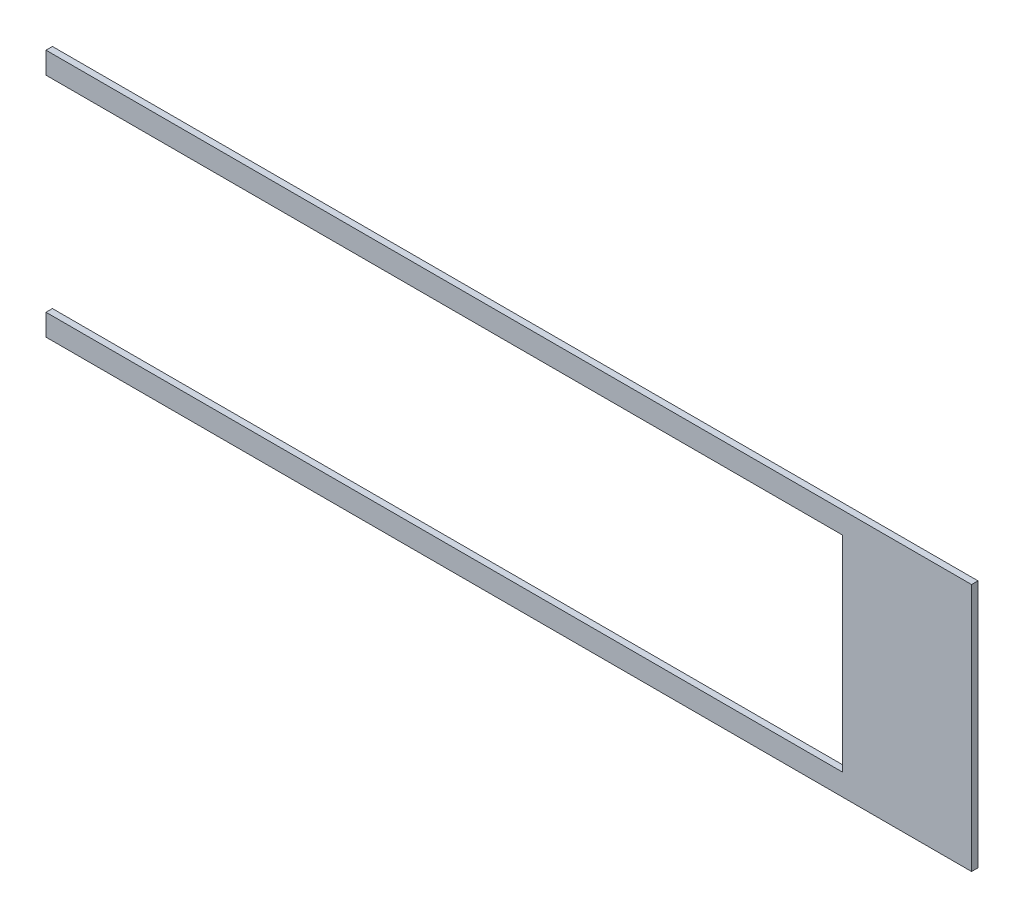
ISO-10303-21;
HEADER;
FILE_DESCRIPTION(('STEP AP214'),'2;1');
FILE_NAME('part.step','',(''),(''),'','','');
FILE_SCHEMA(('AUTOMOTIVE_DESIGN { 1 0 10303 214 1 1 1 1 }'));
ENDSEC;
DATA;
#1=APPLICATION_CONTEXT('core data for automotive mechanical design processes');
#2=APPLICATION_PROTOCOL_DEFINITION('international standard','automotive_design',2000,#1);
#3=PRODUCT_CONTEXT('',#1,'mechanical');
#4=PRODUCT('Part','Part','',(#3));
#5=PRODUCT_RELATED_PRODUCT_CATEGORY('part','',(#4));
#6=PRODUCT_DEFINITION_FORMATION('','',#4);
#7=PRODUCT_DEFINITION_CONTEXT('part definition',#1,'design');
#8=PRODUCT_DEFINITION('design','',#6,#7);
#9=PRODUCT_DEFINITION_SHAPE('','',#8);
#10=(LENGTH_UNIT() NAMED_UNIT(*) SI_UNIT(.MILLI.,.METRE.));
#11=(NAMED_UNIT(*) PLANE_ANGLE_UNIT() SI_UNIT($,.RADIAN.));
#12=(NAMED_UNIT(*) SI_UNIT($,.STERADIAN.) SOLID_ANGLE_UNIT());
#13=UNCERTAINTY_MEASURE_WITH_UNIT(LENGTH_MEASURE(1.E-05),#10,'distance_accuracy_value','');
#14=(GEOMETRIC_REPRESENTATION_CONTEXT(3) GLOBAL_UNCERTAINTY_ASSIGNED_CONTEXT((#13)) GLOBAL_UNIT_ASSIGNED_CONTEXT((#10,
#11,#12)) REPRESENTATION_CONTEXT('',''));
#15=CARTESIAN_POINT('',(0.,0.,0.));
#16=DIRECTION('',(0.,0.,1.));
#17=DIRECTION('',(1.,0.,0.));
#18=AXIS2_PLACEMENT_3D('',#15,#16,#17);
#19=CARTESIAN_POINT('',(-228.7016,-50.7492,3.175));
#20=DIRECTION('',(1.,0.,0.));
#21=DIRECTION('',(0.,0.,-1.));
#22=AXIS2_PLACEMENT_3D('',#19,#20,#21);
#23=PLANE('',#22);
#24=DIRECTION('',(0.,-1.,0.));
#25=VECTOR('',#24,1.);
#26=CARTESIAN_POINT('',(-228.7016,-50.7492,0.));
#27=LINE('',#26,#25);
#28=CARTESIAN_POINT('',(-228.7016,-50.7492,0.));
#29=VERTEX_POINT('',#28);
#30=CARTESIAN_POINT('',(-228.7016,-61.4172,0.));
#31=VERTEX_POINT('',#30);
#32=EDGE_CURVE('E140',#29,#31,#27,.T.);
#33=ORIENTED_EDGE('',*,*,#32,.T.);
#34=DIRECTION('',(0.,0.,-1.));
#35=VECTOR('',#34,1.);
#36=CARTESIAN_POINT('',(-228.7016,-61.4172,3.175));
#37=LINE('',#36,#35);
#38=CARTESIAN_POINT('',(-228.7016,-61.4172,3.175));
#39=VERTEX_POINT('',#38);
#40=EDGE_CURVE('E11',#39,#31,#37,.T.);
#41=ORIENTED_EDGE('',*,*,#40,.F.);
#42=DIRECTION('',(0.,-1.,0.));
#43=VECTOR('',#42,1.);
#44=CARTESIAN_POINT('',(-228.7016,-50.7492,3.175));
#45=LINE('',#44,#43);
#46=CARTESIAN_POINT('',(-228.7016,-50.7492,3.175));
#47=VERTEX_POINT('',#46);
#48=EDGE_CURVE('E162',#47,#39,#45,.T.);
#49=ORIENTED_EDGE('',*,*,#48,.F.);
#50=DIRECTION('',(0.,0.,-1.));
#51=VECTOR('',#50,1.);
#52=CARTESIAN_POINT('',(-228.7016,-50.7492,3.175));
#53=LINE('',#52,#51);
#54=EDGE_CURVE('E136',#47,#29,#53,.T.);
#55=ORIENTED_EDGE('',*,*,#54,.T.);
#56=EDGE_LOOP('',(#33,#41,#49,#55));
#57=FACE_BOUND('',#56,.T.);
#58=ADVANCED_FACE('F39',(#57),#23,.F.);
#59=CARTESIAN_POINT('',(-228.7016,-61.4172,3.175));
#60=DIRECTION('',(0.,1.,0.));
#61=DIRECTION('',(0.,0.,1.));
#62=AXIS2_PLACEMENT_3D('',#59,#60,#61);
#63=PLANE('',#62);
#64=DIRECTION('',(1.,0.,0.));
#65=VECTOR('',#64,1.);
#66=CARTESIAN_POINT('',(-228.7016,-61.4172,0.));
#67=LINE('',#66,#65);
#68=CARTESIAN_POINT('',(228.7016,-61.4172,0.));
#69=VERTEX_POINT('',#68);
#70=EDGE_CURVE('E144',#31,#69,#67,.T.);
#71=ORIENTED_EDGE('',*,*,#70,.T.);
#72=DIRECTION('',(0.,0.,-1.));
#73=VECTOR('',#72,1.);
#74=CARTESIAN_POINT('',(228.7016,-61.4172,3.175));
#75=LINE('',#74,#73);
#76=CARTESIAN_POINT('',(228.7016,-61.4172,3.175));
#77=VERTEX_POINT('',#76);
#78=EDGE_CURVE('E48',#77,#69,#75,.T.);
#79=ORIENTED_EDGE('',*,*,#78,.F.);
#80=DIRECTION('',(1.,0.,0.));
#81=VECTOR('',#80,1.);
#82=CARTESIAN_POINT('',(-228.7016,-61.4172,3.175));
#83=LINE('',#82,#81);
#84=EDGE_CURVE('E99',#39,#77,#83,.T.);
#85=ORIENTED_EDGE('',*,*,#84,.F.);
#86=ORIENTED_EDGE('',*,*,#40,.T.);
#87=EDGE_LOOP('',(#71,#79,#85,#86));
#88=FACE_BOUND('',#87,.T.);
#89=ADVANCED_FACE('F208',(#88),#63,.F.);
#90=CARTESIAN_POINT('',(228.7016,-61.4172,3.175));
#91=DIRECTION('',(-1.,0.,0.));
#92=DIRECTION('',(0.,0.,1.));
#93=AXIS2_PLACEMENT_3D('',#90,#91,#92);
#94=PLANE('',#93);
#95=DIRECTION('',(0.,1.,0.));
#96=VECTOR('',#95,1.);
#97=CARTESIAN_POINT('',(228.7016,-61.4172,0.));
#98=LINE('',#97,#96);
#99=CARTESIAN_POINT('',(228.7016,61.4172,0.));
#100=VERTEX_POINT('',#99);
#101=EDGE_CURVE('E147',#69,#100,#98,.T.);
#102=ORIENTED_EDGE('',*,*,#101,.T.);
#103=DIRECTION('',(0.,0.,-1.));
#104=VECTOR('',#103,1.);
#105=CARTESIAN_POINT('',(228.7016,61.4172,3.175));
#106=LINE('',#105,#104);
#107=CARTESIAN_POINT('',(228.7016,61.4172,3.175));
#108=VERTEX_POINT('',#107);
#109=EDGE_CURVE('E173',#108,#100,#106,.T.);
#110=ORIENTED_EDGE('',*,*,#109,.F.);
#111=DIRECTION('',(0.,1.,0.));
#112=VECTOR('',#111,1.);
#113=CARTESIAN_POINT('',(228.7016,-61.4172,3.175));
#114=LINE('',#113,#112);
#115=EDGE_CURVE('E183',#77,#108,#114,.T.);
#116=ORIENTED_EDGE('',*,*,#115,.F.);
#117=ORIENTED_EDGE('',*,*,#78,.T.);
#118=EDGE_LOOP('',(#102,#110,#116,#117));
#119=FACE_BOUND('',#118,.T.);
#120=ADVANCED_FACE('F181',(#119),#94,.F.);
#121=CARTESIAN_POINT('',(228.7016,61.4172,3.175));
#122=DIRECTION('',(0.,-1.,0.));
#123=DIRECTION('',(0.,0.,-1.));
#124=AXIS2_PLACEMENT_3D('',#121,#122,#123);
#125=PLANE('',#124);
#126=DIRECTION('',(-1.,0.,0.));
#127=VECTOR('',#126,1.);
#128=CARTESIAN_POINT('',(228.7016,61.4172,0.));
#129=LINE('',#128,#127);
#130=CARTESIAN_POINT('',(-228.7016,61.4172,0.));
#131=VERTEX_POINT('',#130);
#132=EDGE_CURVE('E150',#100,#131,#129,.T.);
#133=ORIENTED_EDGE('',*,*,#132,.T.);
#134=DIRECTION('',(0.,0.,-1.));
#135=VECTOR('',#134,1.);
#136=CARTESIAN_POINT('',(-228.7016,61.4172,3.175));
#137=LINE('',#136,#135);
#138=CARTESIAN_POINT('',(-228.7016,61.4172,3.175));
#139=VERTEX_POINT('',#138);
#140=EDGE_CURVE('E169',#139,#131,#137,.T.);
#141=ORIENTED_EDGE('',*,*,#140,.F.);
#142=DIRECTION('',(-1.,0.,0.));
#143=VECTOR('',#142,1.);
#144=CARTESIAN_POINT('',(228.7016,61.4172,3.175));
#145=LINE('',#144,#143);
#146=EDGE_CURVE('E196',#108,#139,#145,.T.);
#147=ORIENTED_EDGE('',*,*,#146,.F.);
#148=ORIENTED_EDGE('',*,*,#109,.T.);
#149=EDGE_LOOP('',(#133,#141,#147,#148));
#150=FACE_BOUND('',#149,.T.);
#151=ADVANCED_FACE('F191',(#150),#125,.F.);
#152=CARTESIAN_POINT('',(-228.7016,61.4172,3.175));
#153=DIRECTION('',(1.,0.,0.));
#154=DIRECTION('',(0.,0.,-1.));
#155=AXIS2_PLACEMENT_3D('',#152,#153,#154);
#156=PLANE('',#155);
#157=DIRECTION('',(0.,-1.,0.));
#158=VECTOR('',#157,1.);
#159=CARTESIAN_POINT('',(-228.7016,61.4172,0.));
#160=LINE('',#159,#158);
#161=CARTESIAN_POINT('',(-228.7016,50.6984,0.));
#162=VERTEX_POINT('',#161);
#163=EDGE_CURVE('E153',#131,#162,#160,.T.);
#164=ORIENTED_EDGE('',*,*,#163,.T.);
#165=DIRECTION('',(0.,0.,-1.));
#166=VECTOR('',#165,1.);
#167=CARTESIAN_POINT('',(-228.7016,50.6984,3.175));
#168=LINE('',#167,#166);
#169=CARTESIAN_POINT('',(-228.7016,50.6984,3.175));
#170=VERTEX_POINT('',#169);
#171=EDGE_CURVE('E129',#170,#162,#168,.T.);
#172=ORIENTED_EDGE('',*,*,#171,.F.);
#173=DIRECTION('',(0.,-1.,0.));
#174=VECTOR('',#173,1.);
#175=CARTESIAN_POINT('',(-228.7016,61.4172,3.175));
#176=LINE('',#175,#174);
#177=EDGE_CURVE('E118',#139,#170,#176,.T.);
#178=ORIENTED_EDGE('',*,*,#177,.F.);
#179=ORIENTED_EDGE('',*,*,#140,.T.);
#180=EDGE_LOOP('',(#164,#172,#178,#179));
#181=FACE_BOUND('',#180,.T.);
#182=ADVANCED_FACE('F194',(#181),#156,.F.);
#183=CARTESIAN_POINT('',(-228.7016,50.6984,3.175));
#184=DIRECTION('',(0.,1.,0.));
#185=DIRECTION('',(0.,0.,1.));
#186=AXIS2_PLACEMENT_3D('',#183,#184,#185);
#187=PLANE('',#186);
#188=DIRECTION('',(1.,0.,0.));
#189=VECTOR('',#188,1.);
#190=CARTESIAN_POINT('',(-228.7016,50.6984,0.));
#191=LINE('',#190,#189);
#192=CARTESIAN_POINT('',(164.9984,50.6984,0.));
#193=VERTEX_POINT('',#192);
#194=EDGE_CURVE('E127',#162,#193,#191,.T.);
#195=ORIENTED_EDGE('',*,*,#194,.T.);
#196=DIRECTION('',(0.,0.,-1.));
#197=VECTOR('',#196,1.);
#198=CARTESIAN_POINT('',(164.9984,50.6984,3.175));
#199=LINE('',#198,#197);
#200=CARTESIAN_POINT('',(164.9984,50.6984,3.175));
#201=VERTEX_POINT('',#200);
#202=EDGE_CURVE('E124',#201,#193,#199,.T.);
#203=ORIENTED_EDGE('',*,*,#202,.F.);
#204=DIRECTION('',(1.,0.,0.));
#205=VECTOR('',#204,1.);
#206=CARTESIAN_POINT('',(-228.7016,50.6984,3.175));
#207=LINE('',#206,#205);
#208=EDGE_CURVE('E112',#170,#201,#207,.T.);
#209=ORIENTED_EDGE('',*,*,#208,.F.);
#210=ORIENTED_EDGE('',*,*,#171,.T.);
#211=EDGE_LOOP('',(#195,#203,#209,#210));
#212=FACE_BOUND('',#211,.T.);
#213=ADVANCED_FACE('F125',(#212),#187,.F.);
#214=CARTESIAN_POINT('',(164.9984,50.6984,3.175));
#215=DIRECTION('',(1.,0.,0.));
#216=DIRECTION('',(0.,0.,-1.));
#217=AXIS2_PLACEMENT_3D('',#214,#215,#216);
#218=PLANE('',#217);
#219=DIRECTION('',(0.,-1.,0.));
#220=VECTOR('',#219,1.);
#221=CARTESIAN_POINT('',(164.9984,50.6984,0.));
#222=LINE('',#221,#220);
#223=CARTESIAN_POINT('',(164.9984,-50.7492,0.));
#224=VERTEX_POINT('',#223);
#225=EDGE_CURVE('E85',#193,#224,#222,.T.);
#226=ORIENTED_EDGE('',*,*,#225,.T.);
#227=DIRECTION('',(0.,0.,-1.));
#228=VECTOR('',#227,1.);
#229=CARTESIAN_POINT('',(164.9984,-50.7492,3.175));
#230=LINE('',#229,#228);
#231=CARTESIAN_POINT('',(164.9984,-50.7492,3.175));
#232=VERTEX_POINT('',#231);
#233=EDGE_CURVE('E130',#232,#224,#230,.T.);
#234=ORIENTED_EDGE('',*,*,#233,.F.);
#235=DIRECTION('',(0.,-1.,0.));
#236=VECTOR('',#235,1.);
#237=CARTESIAN_POINT('',(164.9984,50.6984,3.175));
#238=LINE('',#237,#236);
#239=EDGE_CURVE('E116',#201,#232,#238,.T.);
#240=ORIENTED_EDGE('',*,*,#239,.F.);
#241=ORIENTED_EDGE('',*,*,#202,.T.);
#242=EDGE_LOOP('',(#226,#234,#240,#241));
#243=FACE_BOUND('',#242,.T.);
#244=ADVANCED_FACE('F132',(#243),#218,.F.);
#245=CARTESIAN_POINT('',(164.9984,-50.7492,3.175));
#246=DIRECTION('',(0.,-1.,0.));
#247=DIRECTION('',(0.,0.,-1.));
#248=AXIS2_PLACEMENT_3D('',#245,#246,#247);
#249=PLANE('',#248);
#250=DIRECTION('',(-1.,0.,0.));
#251=VECTOR('',#250,1.);
#252=CARTESIAN_POINT('',(164.9984,-50.7492,0.));
#253=LINE('',#252,#251);
#254=EDGE_CURVE('E91',#224,#29,#253,.T.);
#255=ORIENTED_EDGE('',*,*,#254,.T.);
#256=ORIENTED_EDGE('',*,*,#54,.F.);
#257=DIRECTION('',(-1.,0.,0.));
#258=VECTOR('',#257,1.);
#259=CARTESIAN_POINT('',(164.9984,-50.7492,3.175));
#260=LINE('',#259,#258);
#261=EDGE_CURVE('E56',#232,#47,#260,.T.);
#262=ORIENTED_EDGE('',*,*,#261,.F.);
#263=ORIENTED_EDGE('',*,*,#233,.T.);
#264=EDGE_LOOP('',(#255,#256,#262,#263));
#265=FACE_BOUND('',#264,.T.);
#266=ADVANCED_FACE('F224',(#265),#249,.F.);
#267=CARTESIAN_POINT('',(0.,0.,3.175));
#268=DIRECTION('',(0.,0.,1.));
#269=DIRECTION('',(1.,0.,0.));
#270=AXIS2_PLACEMENT_3D('',#267,#268,#269);
#271=PLANE('',#270);
#272=ORIENTED_EDGE('',*,*,#48,.T.);
#273=ORIENTED_EDGE('',*,*,#84,.T.);
#274=ORIENTED_EDGE('',*,*,#115,.T.);
#275=ORIENTED_EDGE('',*,*,#146,.T.);
#276=ORIENTED_EDGE('',*,*,#177,.T.);
#277=ORIENTED_EDGE('',*,*,#208,.T.);
#278=ORIENTED_EDGE('',*,*,#239,.T.);
#279=ORIENTED_EDGE('',*,*,#261,.T.);
#280=EDGE_LOOP('',(#272,#273,#274,#275,#276,#277,#278,#279));
#281=FACE_BOUND('',#280,.T.);
#282=ADVANCED_FACE('F114',(#281),#271,.T.);
#283=CARTESIAN_POINT('',(0.,0.,0.));
#284=DIRECTION('',(0.,0.,1.));
#285=DIRECTION('',(1.,0.,0.));
#286=AXIS2_PLACEMENT_3D('',#283,#284,#285);
#287=PLANE('',#286);
#288=ORIENTED_EDGE('',*,*,#32,.F.);
#289=ORIENTED_EDGE('',*,*,#254,.F.);
#290=ORIENTED_EDGE('',*,*,#225,.F.);
#291=ORIENTED_EDGE('',*,*,#194,.F.);
#292=ORIENTED_EDGE('',*,*,#163,.F.);
#293=ORIENTED_EDGE('',*,*,#132,.F.);
#294=ORIENTED_EDGE('',*,*,#101,.F.);
#295=ORIENTED_EDGE('',*,*,#70,.F.);
#296=EDGE_LOOP('',(#288,#289,#290,#291,#292,#293,#294,#295));
#297=FACE_BOUND('',#296,.T.);
#298=ADVANCED_FACE('F187',(#297),#287,.F.);
#299=CLOSED_SHELL('',(#58,#89,#120,#151,#182,#213,#244,#266,#282,#298));
#300=MANIFOLD_SOLID_BREP('B2',#299);
#301=ADVANCED_BREP_SHAPE_REPRESENTATION('',(#18,#300),#14);
#302=SHAPE_DEFINITION_REPRESENTATION(#9,#301);
ENDSEC;
END-ISO-10303-21;
